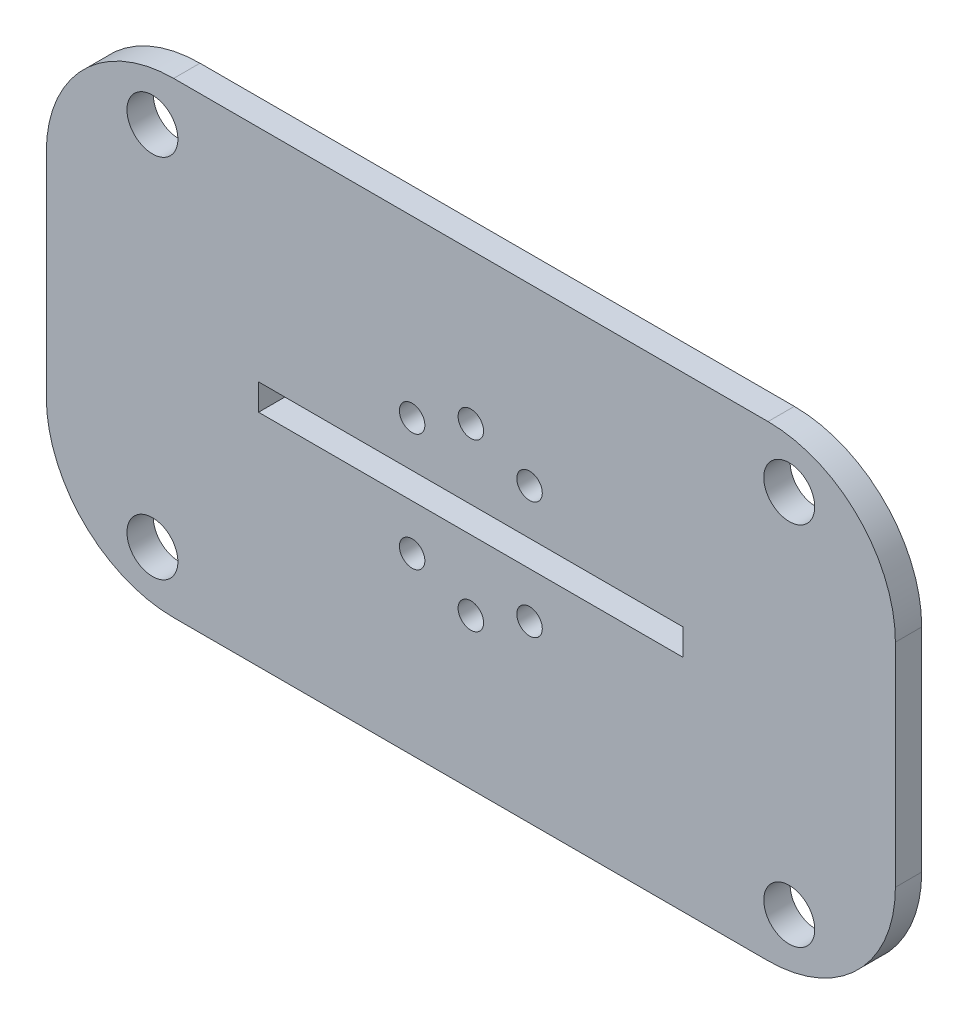
ISO-10303-21;
HEADER;
FILE_DESCRIPTION(('STEP AP214'),'2;1');
FILE_NAME('part.step','',(''),(''),'','','');
FILE_SCHEMA(('AUTOMOTIVE_DESIGN { 1 0 10303 214 1 1 1 1 }'));
ENDSEC;
DATA;
#1=APPLICATION_CONTEXT('core data for automotive mechanical design processes');
#2=APPLICATION_PROTOCOL_DEFINITION('international standard','automotive_design',2000,#1);
#3=PRODUCT_CONTEXT('',#1,'mechanical');
#4=PRODUCT('Part','Part','',(#3));
#5=PRODUCT_RELATED_PRODUCT_CATEGORY('part','',(#4));
#6=PRODUCT_DEFINITION_FORMATION('','',#4);
#7=PRODUCT_DEFINITION_CONTEXT('part definition',#1,'design');
#8=PRODUCT_DEFINITION('design','',#6,#7);
#9=PRODUCT_DEFINITION_SHAPE('','',#8);
#10=(LENGTH_UNIT() NAMED_UNIT(*) SI_UNIT(.MILLI.,.METRE.));
#11=(NAMED_UNIT(*) PLANE_ANGLE_UNIT() SI_UNIT($,.RADIAN.));
#12=(NAMED_UNIT(*) SI_UNIT($,.STERADIAN.) SOLID_ANGLE_UNIT());
#13=UNCERTAINTY_MEASURE_WITH_UNIT(LENGTH_MEASURE(1.E-05),#10,'distance_accuracy_value','');
#14=(GEOMETRIC_REPRESENTATION_CONTEXT(3) GLOBAL_UNCERTAINTY_ASSIGNED_CONTEXT((#13)) GLOBAL_UNIT_ASSIGNED_CONTEXT((#10,
#11,#12)) REPRESENTATION_CONTEXT('',''));
#15=CARTESIAN_POINT('',(0.,0.,0.));
#16=DIRECTION('',(0.,0.,1.));
#17=DIRECTION('',(1.,0.,0.));
#18=AXIS2_PLACEMENT_3D('',#15,#16,#17);
#19=CARTESIAN_POINT('',(0.,0.,3.1));
#20=DIRECTION('',(0.,0.,-1.));
#21=DIRECTION('',(-1.,0.,0.));
#22=AXIS2_PLACEMENT_3D('',#19,#20,#21);
#23=PLANE('',#22);
#24=CARTESIAN_POINT('',(-6.91479721322323,-6.91479721322326,3.1));
#25=DIRECTION('',(0.,0.,1.));
#26=DIRECTION('',(1.,0.,0.));
#27=AXIS2_PLACEMENT_3D('',#24,#25,#26);
#28=CIRCLE('',#27,1.5);
#29=CARTESIAN_POINT('',(-5.41479721322323,-6.91479721322326,3.1));
#30=VERTEX_POINT('',#29);
#31=EDGE_CURVE('E545',#30,#30,#28,.T.);
#32=ORIENTED_EDGE('',*,*,#31,.F.);
#33=EDGE_LOOP('',(#32));
#34=FACE_BOUND('',#33,.T.);
#35=CARTESIAN_POINT('',(0.,-9.779,3.1));
#36=DIRECTION('',(0.,0.,1.));
#37=DIRECTION('',(1.,0.,0.));
#38=AXIS2_PLACEMENT_3D('',#35,#36,#37);
#39=CIRCLE('',#38,1.5);
#40=CARTESIAN_POINT('',(1.50000000000002,-9.779,3.1));
#41=VERTEX_POINT('',#40);
#42=EDGE_CURVE('E539',#41,#41,#39,.T.);
#43=ORIENTED_EDGE('',*,*,#42,.F.);
#44=EDGE_LOOP('',(#43));
#45=FACE_BOUND('',#44,.T.);
#46=CARTESIAN_POINT('',(6.91479721322326,-6.91479721322323,3.1));
#47=DIRECTION('',(0.,0.,1.));
#48=DIRECTION('',(1.,0.,0.));
#49=AXIS2_PLACEMENT_3D('',#46,#47,#48);
#50=CIRCLE('',#49,1.5);
#51=CARTESIAN_POINT('',(8.41479721322326,-6.91479721322323,3.1));
#52=VERTEX_POINT('',#51);
#53=EDGE_CURVE('E533',#52,#52,#50,.T.);
#54=ORIENTED_EDGE('',*,*,#53,.F.);
#55=EDGE_LOOP('',(#54));
#56=FACE_BOUND('',#55,.T.);
#57=CARTESIAN_POINT('',(6.91479721322323,6.91479721322326,3.1));
#58=DIRECTION('',(0.,0.,1.));
#59=DIRECTION('',(1.,0.,0.));
#60=AXIS2_PLACEMENT_3D('',#57,#58,#59);
#61=CIRCLE('',#60,1.5);
#62=CARTESIAN_POINT('',(8.41479721322324,6.91479721322326,3.1));
#63=VERTEX_POINT('',#62);
#64=EDGE_CURVE('E527',#63,#63,#61,.T.);
#65=ORIENTED_EDGE('',*,*,#64,.F.);
#66=EDGE_LOOP('',(#65));
#67=FACE_BOUND('',#66,.T.);
#68=CARTESIAN_POINT('',(0.,9.779,3.1));
#69=DIRECTION('',(0.,0.,1.));
#70=DIRECTION('',(1.,0.,0.));
#71=AXIS2_PLACEMENT_3D('',#68,#69,#70);
#72=CIRCLE('',#71,1.49999999999994);
#73=CARTESIAN_POINT('',(1.49999999999992,9.779,3.1));
#74=VERTEX_POINT('',#73);
#75=EDGE_CURVE('E521',#74,#74,#72,.T.);
#76=ORIENTED_EDGE('',*,*,#75,.F.);
#77=EDGE_LOOP('',(#76));
#78=FACE_BOUND('',#77,.T.);
#79=CARTESIAN_POINT('',(-6.91479721322326,6.91479721322323,3.1));
#80=DIRECTION('',(0.,0.,1.));
#81=DIRECTION('',(1.,0.,0.));
#82=AXIS2_PLACEMENT_3D('',#79,#80,#81);
#83=CIRCLE('',#82,1.5);
#84=CARTESIAN_POINT('',(-5.41479721322326,6.91479721322323,3.1));
#85=VERTEX_POINT('',#84);
#86=EDGE_CURVE('E488',#85,#85,#83,.T.);
#87=ORIENTED_EDGE('',*,*,#86,.F.);
#88=EDGE_LOOP('',(#87));
#89=FACE_BOUND('',#88,.T.);
#90=CARTESIAN_POINT('',(-37.5,-21.55,3.1));
#91=DIRECTION('',(0.,0.,1.));
#92=DIRECTION('',(1.,0.,0.));
#93=AXIS2_PLACEMENT_3D('',#90,#91,#92);
#94=CIRCLE('',#93,3.);
#95=CARTESIAN_POINT('',(-34.5,-21.55,3.1));
#96=VERTEX_POINT('',#95);
#97=EDGE_CURVE('E492',#96,#96,#94,.T.);
#98=ORIENTED_EDGE('',*,*,#97,.F.);
#99=EDGE_LOOP('',(#98));
#100=FACE_BOUND('',#99,.T.);
#101=CARTESIAN_POINT('',(37.5,21.55,3.1));
#102=DIRECTION('',(0.,0.,1.));
#103=DIRECTION('',(1.,0.,0.));
#104=AXIS2_PLACEMENT_3D('',#101,#102,#103);
#105=CIRCLE('',#104,3.);
#106=CARTESIAN_POINT('',(40.5,21.55,3.1));
#107=VERTEX_POINT('',#106);
#108=EDGE_CURVE('E157',#107,#107,#105,.T.);
#109=ORIENTED_EDGE('',*,*,#108,.F.);
#110=EDGE_LOOP('',(#109));
#111=FACE_BOUND('',#110,.T.);
#112=DIRECTION('',(-1.,0.,0.));
#113=VECTOR('',#112,1.);
#114=CARTESIAN_POINT('',(-50.,27.5,3.1));
#115=LINE('',#114,#113);
#116=CARTESIAN_POINT('',(35.,27.5,3.1));
#117=VERTEX_POINT('',#116);
#118=CARTESIAN_POINT('',(-35.,27.5,3.1));
#119=VERTEX_POINT('',#118);
#120=EDGE_CURVE('E171',#117,#119,#115,.T.);
#121=ORIENTED_EDGE('',*,*,#120,.T.);
#122=CARTESIAN_POINT('',(-35.,12.5,3.1));
#123=DIRECTION('',(0.,0.,-1.));
#124=DIRECTION('',(-1.,0.,0.));
#125=AXIS2_PLACEMENT_3D('',#122,#123,#124);
#126=CIRCLE('',#125,15.);
#127=CARTESIAN_POINT('',(-50.,12.5,3.1));
#128=VERTEX_POINT('',#127);
#129=EDGE_CURVE('E211',#119,#128,#126,.F.);
#130=ORIENTED_EDGE('',*,*,#129,.T.);
#131=DIRECTION('',(0.,-1.,0.));
#132=VECTOR('',#131,1.);
#133=CARTESIAN_POINT('',(-50.,-27.5,3.1));
#134=LINE('',#133,#132);
#135=CARTESIAN_POINT('',(-50.,-12.5,3.1));
#136=VERTEX_POINT('',#135);
#137=EDGE_CURVE('E175',#128,#136,#134,.T.);
#138=ORIENTED_EDGE('',*,*,#137,.T.);
#139=CARTESIAN_POINT('',(-35.,-12.5,3.1));
#140=DIRECTION('',(0.,0.,-1.));
#141=DIRECTION('',(-1.,0.,0.));
#142=AXIS2_PLACEMENT_3D('',#139,#140,#141);
#143=CIRCLE('',#142,15.);
#144=CARTESIAN_POINT('',(-35.,-27.5,3.1));
#145=VERTEX_POINT('',#144);
#146=EDGE_CURVE('E54',#136,#145,#143,.F.);
#147=ORIENTED_EDGE('',*,*,#146,.T.);
#148=DIRECTION('',(1.,0.,0.));
#149=VECTOR('',#148,1.);
#150=CARTESIAN_POINT('',(-50.,-27.5,3.1));
#151=LINE('',#150,#149);
#152=CARTESIAN_POINT('',(35.,-27.5,3.1));
#153=VERTEX_POINT('',#152);
#154=EDGE_CURVE('E177',#145,#153,#151,.T.);
#155=ORIENTED_EDGE('',*,*,#154,.T.);
#156=CARTESIAN_POINT('',(35.,-12.5,3.1));
#157=DIRECTION('',(0.,0.,-1.));
#158=DIRECTION('',(-1.,0.,0.));
#159=AXIS2_PLACEMENT_3D('',#156,#157,#158);
#160=CIRCLE('',#159,15.);
#161=CARTESIAN_POINT('',(50.,-12.5,3.1));
#162=VERTEX_POINT('',#161);
#163=EDGE_CURVE('E208',#153,#162,#160,.F.);
#164=ORIENTED_EDGE('',*,*,#163,.T.);
#165=DIRECTION('',(0.,1.,0.));
#166=VECTOR('',#165,1.);
#167=CARTESIAN_POINT('',(50.,-27.5,3.1));
#168=LINE('',#167,#166);
#169=CARTESIAN_POINT('',(50.,12.5,3.1));
#170=VERTEX_POINT('',#169);
#171=EDGE_CURVE('E168',#162,#170,#168,.T.);
#172=ORIENTED_EDGE('',*,*,#171,.T.);
#173=CARTESIAN_POINT('',(35.,12.5,3.1));
#174=DIRECTION('',(0.,0.,-1.));
#175=DIRECTION('',(-1.,0.,0.));
#176=AXIS2_PLACEMENT_3D('',#173,#174,#175);
#177=CIRCLE('',#176,15.);
#178=EDGE_CURVE('E206',#170,#117,#177,.F.);
#179=ORIENTED_EDGE('',*,*,#178,.T.);
#180=EDGE_LOOP('',(#121,#130,#138,#147,#155,#164,#172,#179));
#181=FACE_BOUND('',#180,.T.);
#182=DIRECTION('',(0.,1.,0.));
#183=VECTOR('',#182,1.);
#184=CARTESIAN_POINT('',(25.,-1.55,3.1));
#185=LINE('',#184,#183);
#186=CARTESIAN_POINT('',(25.,-1.55,3.1));
#187=VERTEX_POINT('',#186);
#188=CARTESIAN_POINT('',(25.,1.55,3.1));
#189=VERTEX_POINT('',#188);
#190=EDGE_CURVE('E124',#187,#189,#185,.T.);
#191=ORIENTED_EDGE('',*,*,#190,.F.);
#192=DIRECTION('',(1.,0.,0.));
#193=VECTOR('',#192,1.);
#194=CARTESIAN_POINT('',(-25.,-1.55,3.1));
#195=LINE('',#194,#193);
#196=CARTESIAN_POINT('',(-25.,-1.55,3.1));
#197=VERTEX_POINT('',#196);
#198=EDGE_CURVE('E150',#197,#187,#195,.T.);
#199=ORIENTED_EDGE('',*,*,#198,.F.);
#200=DIRECTION('',(0.,-1.,0.));
#201=VECTOR('',#200,1.);
#202=CARTESIAN_POINT('',(-25.,-1.55,3.1));
#203=LINE('',#202,#201);
#204=CARTESIAN_POINT('',(-25.,1.55,3.1));
#205=VERTEX_POINT('',#204);
#206=EDGE_CURVE('E148',#205,#197,#203,.T.);
#207=ORIENTED_EDGE('',*,*,#206,.F.);
#208=DIRECTION('',(-1.,0.,0.));
#209=VECTOR('',#208,1.);
#210=CARTESIAN_POINT('',(-25.,1.55,3.1));
#211=LINE('',#210,#209);
#212=EDGE_CURVE('E134',#189,#205,#211,.T.);
#213=ORIENTED_EDGE('',*,*,#212,.F.);
#214=EDGE_LOOP('',(#191,#199,#207,#213));
#215=FACE_BOUND('',#214,.T.);
#216=CARTESIAN_POINT('',(-37.5,21.55,3.1));
#217=DIRECTION('',(0.,0.,1.));
#218=DIRECTION('',(-1.,0.,0.));
#219=AXIS2_PLACEMENT_3D('',#216,#217,#218);
#220=CIRCLE('',#219,3.);
#221=CARTESIAN_POINT('',(-40.5,21.55,3.1));
#222=VERTEX_POINT('',#221);
#223=EDGE_CURVE('E497',#222,#222,#220,.T.);
#224=ORIENTED_EDGE('',*,*,#223,.F.);
#225=EDGE_LOOP('',(#224));
#226=FACE_BOUND('',#225,.T.);
#227=CARTESIAN_POINT('',(37.5,-21.55,3.1));
#228=DIRECTION('',(0.,0.,1.));
#229=DIRECTION('',(-1.,0.,0.));
#230=AXIS2_PLACEMENT_3D('',#227,#228,#229);
#231=CIRCLE('',#230,3.);
#232=CARTESIAN_POINT('',(34.5,-21.55,3.1));
#233=VERTEX_POINT('',#232);
#234=EDGE_CURVE('E481',#233,#233,#231,.T.);
#235=ORIENTED_EDGE('',*,*,#234,.F.);
#236=EDGE_LOOP('',(#235));
#237=FACE_BOUND('',#236,.T.);
#238=ADVANCED_FACE('F32',(#34,#45,#56,#67,#78,#89,#100,#111,#181,#215,#226,#237),#23,.F.);
#239=CARTESIAN_POINT('',(0.,0.,0.));
#240=DIRECTION('',(0.,0.,-1.));
#241=DIRECTION('',(-1.,0.,0.));
#242=AXIS2_PLACEMENT_3D('',#239,#240,#241);
#243=PLANE('',#242);
#244=CARTESIAN_POINT('',(-6.91479721322323,-6.91479721322326,0.));
#245=DIRECTION('',(0.,0.,1.));
#246=DIRECTION('',(1.,0.,0.));
#247=AXIS2_PLACEMENT_3D('',#244,#245,#246);
#248=CIRCLE('',#247,1.5);
#249=CARTESIAN_POINT('',(-5.41479721322323,-6.91479721322326,0.));
#250=VERTEX_POINT('',#249);
#251=EDGE_CURVE('E542',#250,#250,#248,.T.);
#252=ORIENTED_EDGE('',*,*,#251,.T.);
#253=EDGE_LOOP('',(#252));
#254=FACE_BOUND('',#253,.T.);
#255=CARTESIAN_POINT('',(0.,-9.779,0.));
#256=DIRECTION('',(0.,0.,1.));
#257=DIRECTION('',(1.,0.,0.));
#258=AXIS2_PLACEMENT_3D('',#255,#256,#257);
#259=CIRCLE('',#258,1.5);
#260=CARTESIAN_POINT('',(1.50000000000002,-9.779,0.));
#261=VERTEX_POINT('',#260);
#262=EDGE_CURVE('E536',#261,#261,#259,.T.);
#263=ORIENTED_EDGE('',*,*,#262,.T.);
#264=EDGE_LOOP('',(#263));
#265=FACE_BOUND('',#264,.T.);
#266=CARTESIAN_POINT('',(6.91479721322326,-6.91479721322323,0.));
#267=DIRECTION('',(0.,0.,1.));
#268=DIRECTION('',(1.,0.,0.));
#269=AXIS2_PLACEMENT_3D('',#266,#267,#268);
#270=CIRCLE('',#269,1.5);
#271=CARTESIAN_POINT('',(8.41479721322326,-6.91479721322323,0.));
#272=VERTEX_POINT('',#271);
#273=EDGE_CURVE('E530',#272,#272,#270,.T.);
#274=ORIENTED_EDGE('',*,*,#273,.T.);
#275=EDGE_LOOP('',(#274));
#276=FACE_BOUND('',#275,.T.);
#277=CARTESIAN_POINT('',(6.91479721322323,6.91479721322326,0.));
#278=DIRECTION('',(0.,0.,1.));
#279=DIRECTION('',(1.,0.,0.));
#280=AXIS2_PLACEMENT_3D('',#277,#278,#279);
#281=CIRCLE('',#280,1.5);
#282=CARTESIAN_POINT('',(8.41479721322324,6.91479721322326,0.));
#283=VERTEX_POINT('',#282);
#284=EDGE_CURVE('E524',#283,#283,#281,.T.);
#285=ORIENTED_EDGE('',*,*,#284,.T.);
#286=EDGE_LOOP('',(#285));
#287=FACE_BOUND('',#286,.T.);
#288=CARTESIAN_POINT('',(0.,9.779,0.));
#289=DIRECTION('',(0.,0.,1.));
#290=DIRECTION('',(1.,0.,0.));
#291=AXIS2_PLACEMENT_3D('',#288,#289,#290);
#292=CIRCLE('',#291,1.49999999999994);
#293=CARTESIAN_POINT('',(1.49999999999992,9.779,0.));
#294=VERTEX_POINT('',#293);
#295=EDGE_CURVE('E519',#294,#294,#292,.T.);
#296=ORIENTED_EDGE('',*,*,#295,.T.);
#297=EDGE_LOOP('',(#296));
#298=FACE_BOUND('',#297,.T.);
#299=CARTESIAN_POINT('',(-6.91479721322326,6.91479721322323,0.));
#300=DIRECTION('',(0.,0.,1.));
#301=DIRECTION('',(1.,0.,0.));
#302=AXIS2_PLACEMENT_3D('',#299,#300,#301);
#303=CIRCLE('',#302,1.5);
#304=CARTESIAN_POINT('',(-5.41479721322326,6.91479721322323,0.));
#305=VERTEX_POINT('',#304);
#306=EDGE_CURVE('E482',#305,#305,#303,.T.);
#307=ORIENTED_EDGE('',*,*,#306,.T.);
#308=EDGE_LOOP('',(#307));
#309=FACE_BOUND('',#308,.T.);
#310=CARTESIAN_POINT('',(-37.5,-21.55,0.));
#311=DIRECTION('',(0.,0.,1.));
#312=DIRECTION('',(1.,0.,0.));
#313=AXIS2_PLACEMENT_3D('',#310,#311,#312);
#314=CIRCLE('',#313,3.);
#315=CARTESIAN_POINT('',(-34.5,-21.55,0.));
#316=VERTEX_POINT('',#315);
#317=EDGE_CURVE('E485',#316,#316,#314,.T.);
#318=ORIENTED_EDGE('',*,*,#317,.T.);
#319=EDGE_LOOP('',(#318));
#320=FACE_BOUND('',#319,.T.);
#321=CARTESIAN_POINT('',(37.5,21.55,0.));
#322=DIRECTION('',(0.,0.,1.));
#323=DIRECTION('',(1.,0.,0.));
#324=AXIS2_PLACEMENT_3D('',#321,#322,#323);
#325=CIRCLE('',#324,3.);
#326=CARTESIAN_POINT('',(40.5,21.55,0.));
#327=VERTEX_POINT('',#326);
#328=EDGE_CURVE('E500',#327,#327,#325,.T.);
#329=ORIENTED_EDGE('',*,*,#328,.T.);
#330=EDGE_LOOP('',(#329));
#331=FACE_BOUND('',#330,.T.);
#332=DIRECTION('',(0.,-1.,0.));
#333=VECTOR('',#332,1.);
#334=CARTESIAN_POINT('',(-50.,-27.5,0.));
#335=LINE('',#334,#333);
#336=CARTESIAN_POINT('',(-50.,12.5,0.));
#337=VERTEX_POINT('',#336);
#338=CARTESIAN_POINT('',(-50.,-12.5,0.));
#339=VERTEX_POINT('',#338);
#340=EDGE_CURVE('E185',#337,#339,#335,.T.);
#341=ORIENTED_EDGE('',*,*,#340,.F.);
#342=CARTESIAN_POINT('',(-35.,12.5,0.));
#343=DIRECTION('',(0.,0.,-1.));
#344=DIRECTION('',(-1.,0.,0.));
#345=AXIS2_PLACEMENT_3D('',#342,#343,#344);
#346=CIRCLE('',#345,15.);
#347=CARTESIAN_POINT('',(-35.,27.5,0.));
#348=VERTEX_POINT('',#347);
#349=EDGE_CURVE('E199',#337,#348,#346,.T.);
#350=ORIENTED_EDGE('',*,*,#349,.T.);
#351=DIRECTION('',(-1.,0.,0.));
#352=VECTOR('',#351,1.);
#353=CARTESIAN_POINT('',(-50.,27.5,0.));
#354=LINE('',#353,#352);
#355=CARTESIAN_POINT('',(35.,27.5,0.));
#356=VERTEX_POINT('',#355);
#357=EDGE_CURVE('E182',#356,#348,#354,.T.);
#358=ORIENTED_EDGE('',*,*,#357,.F.);
#359=CARTESIAN_POINT('',(35.,12.5,0.));
#360=DIRECTION('',(0.,0.,-1.));
#361=DIRECTION('',(-1.,0.,0.));
#362=AXIS2_PLACEMENT_3D('',#359,#360,#361);
#363=CIRCLE('',#362,15.);
#364=CARTESIAN_POINT('',(50.,12.5,0.));
#365=VERTEX_POINT('',#364);
#366=EDGE_CURVE('E193',#356,#365,#363,.T.);
#367=ORIENTED_EDGE('',*,*,#366,.T.);
#368=DIRECTION('',(0.,1.,0.));
#369=VECTOR('',#368,1.);
#370=CARTESIAN_POINT('',(50.,-27.5,0.));
#371=LINE('',#370,#369);
#372=CARTESIAN_POINT('',(50.,-12.5,0.));
#373=VERTEX_POINT('',#372);
#374=EDGE_CURVE('E142',#373,#365,#371,.T.);
#375=ORIENTED_EDGE('',*,*,#374,.F.);
#376=CARTESIAN_POINT('',(35.,-12.5,0.));
#377=DIRECTION('',(0.,0.,-1.));
#378=DIRECTION('',(-1.,0.,0.));
#379=AXIS2_PLACEMENT_3D('',#376,#377,#378);
#380=CIRCLE('',#379,15.);
#381=CARTESIAN_POINT('',(35.,-27.5,0.));
#382=VERTEX_POINT('',#381);
#383=EDGE_CURVE('E195',#373,#382,#380,.T.);
#384=ORIENTED_EDGE('',*,*,#383,.T.);
#385=DIRECTION('',(1.,0.,0.));
#386=VECTOR('',#385,1.);
#387=CARTESIAN_POINT('',(-50.,-27.5,0.));
#388=LINE('',#387,#386);
#389=CARTESIAN_POINT('',(-35.,-27.5,0.));
#390=VERTEX_POINT('',#389);
#391=EDGE_CURVE('E172',#390,#382,#388,.T.);
#392=ORIENTED_EDGE('',*,*,#391,.F.);
#393=CARTESIAN_POINT('',(-35.,-12.5,0.));
#394=DIRECTION('',(0.,0.,-1.));
#395=DIRECTION('',(-1.,0.,0.));
#396=AXIS2_PLACEMENT_3D('',#393,#394,#395);
#397=CIRCLE('',#396,15.);
#398=EDGE_CURVE('E197',#390,#339,#397,.T.);
#399=ORIENTED_EDGE('',*,*,#398,.T.);
#400=EDGE_LOOP('',(#341,#350,#358,#367,#375,#384,#392,#399));
#401=FACE_BOUND('',#400,.T.);
#402=DIRECTION('',(1.,0.,0.));
#403=VECTOR('',#402,1.);
#404=CARTESIAN_POINT('',(-25.,-1.55,0.));
#405=LINE('',#404,#403);
#406=CARTESIAN_POINT('',(-25.,-1.55,0.));
#407=VERTEX_POINT('',#406);
#408=CARTESIAN_POINT('',(25.,-1.55,0.));
#409=VERTEX_POINT('',#408);
#410=EDGE_CURVE('E135',#407,#409,#405,.T.);
#411=ORIENTED_EDGE('',*,*,#410,.T.);
#412=DIRECTION('',(0.,1.,0.));
#413=VECTOR('',#412,1.);
#414=CARTESIAN_POINT('',(25.,-1.55,0.));
#415=LINE('',#414,#413);
#416=CARTESIAN_POINT('',(25.,1.55,0.));
#417=VERTEX_POINT('',#416);
#418=EDGE_CURVE('E155',#409,#417,#415,.T.);
#419=ORIENTED_EDGE('',*,*,#418,.T.);
#420=DIRECTION('',(-1.,0.,0.));
#421=VECTOR('',#420,1.);
#422=CARTESIAN_POINT('',(-25.,1.55,0.));
#423=LINE('',#422,#421);
#424=CARTESIAN_POINT('',(-25.,1.55,0.));
#425=VERTEX_POINT('',#424);
#426=EDGE_CURVE('E141',#417,#425,#423,.T.);
#427=ORIENTED_EDGE('',*,*,#426,.T.);
#428=DIRECTION('',(0.,-1.,0.));
#429=VECTOR('',#428,1.);
#430=CARTESIAN_POINT('',(-25.,-1.55,0.));
#431=LINE('',#430,#429);
#432=EDGE_CURVE('E159',#425,#407,#431,.T.);
#433=ORIENTED_EDGE('',*,*,#432,.T.);
#434=EDGE_LOOP('',(#411,#419,#427,#433));
#435=FACE_BOUND('',#434,.T.);
#436=CARTESIAN_POINT('',(-37.5,21.55,0.));
#437=DIRECTION('',(0.,0.,1.));
#438=DIRECTION('',(-1.,0.,0.));
#439=AXIS2_PLACEMENT_3D('',#436,#437,#438);
#440=CIRCLE('',#439,3.);
#441=CARTESIAN_POINT('',(-40.5,21.55,0.));
#442=VERTEX_POINT('',#441);
#443=EDGE_CURVE('E476',#442,#442,#440,.T.);
#444=ORIENTED_EDGE('',*,*,#443,.T.);
#445=EDGE_LOOP('',(#444));
#446=FACE_BOUND('',#445,.T.);
#447=CARTESIAN_POINT('',(37.5,-21.55,0.));
#448=DIRECTION('',(0.,0.,1.));
#449=DIRECTION('',(-1.,0.,0.));
#450=AXIS2_PLACEMENT_3D('',#447,#448,#449);
#451=CIRCLE('',#450,3.);
#452=CARTESIAN_POINT('',(34.5,-21.55,0.));
#453=VERTEX_POINT('',#452);
#454=EDGE_CURVE('E479',#453,#453,#451,.T.);
#455=ORIENTED_EDGE('',*,*,#454,.T.);
#456=EDGE_LOOP('',(#455));
#457=FACE_BOUND('',#456,.T.);
#458=ADVANCED_FACE('F233',(#254,#265,#276,#287,#298,#309,#320,#331,#401,#435,#446,#457),#243,.T.);
#459=CARTESIAN_POINT('',(50.,-27.5,3.1));
#460=DIRECTION('',(-1.,0.,0.));
#461=DIRECTION('',(0.,0.,1.));
#462=AXIS2_PLACEMENT_3D('',#459,#460,#461);
#463=PLANE('',#462);
#464=ORIENTED_EDGE('',*,*,#171,.F.);
#465=DIRECTION('',(0.,0.,-1.));
#466=VECTOR('',#465,1.);
#467=CARTESIAN_POINT('',(50.,-12.5,3.1));
#468=LINE('',#467,#466);
#469=EDGE_CURVE('E11',#162,#373,#468,.T.);
#470=ORIENTED_EDGE('',*,*,#469,.T.);
#471=ORIENTED_EDGE('',*,*,#374,.T.);
#472=DIRECTION('',(0.,0.,-1.));
#473=VECTOR('',#472,1.);
#474=CARTESIAN_POINT('',(50.,12.5,3.1));
#475=LINE('',#474,#473);
#476=EDGE_CURVE('E40',#365,#170,#475,.F.);
#477=ORIENTED_EDGE('',*,*,#476,.T.);
#478=EDGE_LOOP('',(#464,#470,#471,#477));
#479=FACE_BOUND('',#478,.T.);
#480=ADVANCED_FACE('F219',(#479),#463,.F.);
#481=CARTESIAN_POINT('',(-50.,27.5,3.1));
#482=DIRECTION('',(0.,-1.,0.));
#483=DIRECTION('',(0.,0.,-1.));
#484=AXIS2_PLACEMENT_3D('',#481,#482,#483);
#485=PLANE('',#484);
#486=ORIENTED_EDGE('',*,*,#357,.T.);
#487=DIRECTION('',(0.,0.,-1.));
#488=VECTOR('',#487,1.);
#489=CARTESIAN_POINT('',(-35.,27.5,3.1));
#490=LINE('',#489,#488);
#491=EDGE_CURVE('E204',#348,#119,#490,.F.);
#492=ORIENTED_EDGE('',*,*,#491,.T.);
#493=ORIENTED_EDGE('',*,*,#120,.F.);
#494=DIRECTION('',(0.,0.,-1.));
#495=VECTOR('',#494,1.);
#496=CARTESIAN_POINT('',(35.,27.5,3.1));
#497=LINE('',#496,#495);
#498=EDGE_CURVE('E201',#117,#356,#497,.T.);
#499=ORIENTED_EDGE('',*,*,#498,.T.);
#500=EDGE_LOOP('',(#486,#492,#493,#499));
#501=FACE_BOUND('',#500,.T.);
#502=ADVANCED_FACE('F229',(#501),#485,.F.);
#503=CARTESIAN_POINT('',(-50.,-27.5,3.1));
#504=DIRECTION('',(1.,0.,0.));
#505=DIRECTION('',(0.,0.,-1.));
#506=AXIS2_PLACEMENT_3D('',#503,#504,#505);
#507=PLANE('',#506);
#508=ORIENTED_EDGE('',*,*,#137,.F.);
#509=DIRECTION('',(0.,0.,-1.));
#510=VECTOR('',#509,1.);
#511=CARTESIAN_POINT('',(-50.,12.5,3.1));
#512=LINE('',#511,#510);
#513=EDGE_CURVE('E190',#128,#337,#512,.T.);
#514=ORIENTED_EDGE('',*,*,#513,.T.);
#515=ORIENTED_EDGE('',*,*,#340,.T.);
#516=DIRECTION('',(0.,0.,-1.));
#517=VECTOR('',#516,1.);
#518=CARTESIAN_POINT('',(-50.,-12.5,3.1));
#519=LINE('',#518,#517);
#520=EDGE_CURVE('E179',#339,#136,#519,.F.);
#521=ORIENTED_EDGE('',*,*,#520,.T.);
#522=EDGE_LOOP('',(#508,#514,#515,#521));
#523=FACE_BOUND('',#522,.T.);
#524=ADVANCED_FACE('F241',(#523),#507,.F.);
#525=CARTESIAN_POINT('',(-50.,-27.5,3.1));
#526=DIRECTION('',(0.,1.,0.));
#527=DIRECTION('',(0.,0.,1.));
#528=AXIS2_PLACEMENT_3D('',#525,#526,#527);
#529=PLANE('',#528);
#530=ORIENTED_EDGE('',*,*,#154,.F.);
#531=DIRECTION('',(0.,0.,-1.));
#532=VECTOR('',#531,1.);
#533=CARTESIAN_POINT('',(-35.,-27.5,3.1));
#534=LINE('',#533,#532);
#535=EDGE_CURVE('E214',#145,#390,#534,.T.);
#536=ORIENTED_EDGE('',*,*,#535,.T.);
#537=ORIENTED_EDGE('',*,*,#391,.T.);
#538=DIRECTION('',(0.,0.,-1.));
#539=VECTOR('',#538,1.);
#540=CARTESIAN_POINT('',(35.,-27.5,3.1));
#541=LINE('',#540,#539);
#542=EDGE_CURVE('E47',#382,#153,#541,.F.);
#543=ORIENTED_EDGE('',*,*,#542,.T.);
#544=EDGE_LOOP('',(#530,#536,#537,#543));
#545=FACE_BOUND('',#544,.T.);
#546=ADVANCED_FACE('F247',(#545),#529,.F.);
#547=CARTESIAN_POINT('',(25.,-1.55,3.1));
#548=DIRECTION('',(-1.,0.,0.));
#549=DIRECTION('',(0.,0.,1.));
#550=AXIS2_PLACEMENT_3D('',#547,#548,#549);
#551=PLANE('',#550);
#552=ORIENTED_EDGE('',*,*,#418,.F.);
#553=DIRECTION('',(0.,0.,-1.));
#554=VECTOR('',#553,1.);
#555=CARTESIAN_POINT('',(25.,-1.55,3.1));
#556=LINE('',#555,#554);
#557=EDGE_CURVE('E130',#187,#409,#556,.T.);
#558=ORIENTED_EDGE('',*,*,#557,.F.);
#559=ORIENTED_EDGE('',*,*,#190,.T.);
#560=DIRECTION('',(0.,0.,-1.));
#561=VECTOR('',#560,1.);
#562=CARTESIAN_POINT('',(25.,1.55,3.1));
#563=LINE('',#562,#561);
#564=EDGE_CURVE('E127',#189,#417,#563,.T.);
#565=ORIENTED_EDGE('',*,*,#564,.T.);
#566=EDGE_LOOP('',(#552,#558,#559,#565));
#567=FACE_BOUND('',#566,.T.);
#568=ADVANCED_FACE('F126',(#567),#551,.T.);
#569=CARTESIAN_POINT('',(-25.,1.55,3.1));
#570=DIRECTION('',(0.,-1.,0.));
#571=DIRECTION('',(0.,0.,-1.));
#572=AXIS2_PLACEMENT_3D('',#569,#570,#571);
#573=PLANE('',#572);
#574=ORIENTED_EDGE('',*,*,#426,.F.);
#575=ORIENTED_EDGE('',*,*,#564,.F.);
#576=ORIENTED_EDGE('',*,*,#212,.T.);
#577=DIRECTION('',(0.,0.,-1.));
#578=VECTOR('',#577,1.);
#579=CARTESIAN_POINT('',(-25.,1.55,3.1));
#580=LINE('',#579,#578);
#581=EDGE_CURVE('E143',#205,#425,#580,.T.);
#582=ORIENTED_EDGE('',*,*,#581,.T.);
#583=EDGE_LOOP('',(#574,#575,#576,#582));
#584=FACE_BOUND('',#583,.T.);
#585=ADVANCED_FACE('F138',(#584),#573,.T.);
#586=CARTESIAN_POINT('',(-25.,-1.55,3.1));
#587=DIRECTION('',(1.,0.,0.));
#588=DIRECTION('',(0.,0.,-1.));
#589=AXIS2_PLACEMENT_3D('',#586,#587,#588);
#590=PLANE('',#589);
#591=ORIENTED_EDGE('',*,*,#432,.F.);
#592=ORIENTED_EDGE('',*,*,#581,.F.);
#593=ORIENTED_EDGE('',*,*,#206,.T.);
#594=DIRECTION('',(0.,0.,-1.));
#595=VECTOR('',#594,1.);
#596=CARTESIAN_POINT('',(-25.,-1.55,3.1));
#597=LINE('',#596,#595);
#598=EDGE_CURVE('E165',#197,#407,#597,.T.);
#599=ORIENTED_EDGE('',*,*,#598,.T.);
#600=EDGE_LOOP('',(#591,#592,#593,#599));
#601=FACE_BOUND('',#600,.T.);
#602=ADVANCED_FACE('F328',(#601),#590,.T.);
#603=CARTESIAN_POINT('',(-25.,-1.55,3.1));
#604=DIRECTION('',(0.,1.,0.));
#605=DIRECTION('',(0.,0.,1.));
#606=AXIS2_PLACEMENT_3D('',#603,#604,#605);
#607=PLANE('',#606);
#608=ORIENTED_EDGE('',*,*,#410,.F.);
#609=ORIENTED_EDGE('',*,*,#598,.F.);
#610=ORIENTED_EDGE('',*,*,#198,.T.);
#611=ORIENTED_EDGE('',*,*,#557,.T.);
#612=EDGE_LOOP('',(#608,#609,#610,#611));
#613=FACE_BOUND('',#612,.T.);
#614=ADVANCED_FACE('F324',(#613),#607,.T.);
#615=CARTESIAN_POINT('',(37.5,21.55,3.1));
#616=DIRECTION('',(0.,0.,-1.));
#617=DIRECTION('',(-1.,0.,0.));
#618=AXIS2_PLACEMENT_3D('',#615,#616,#617);
#619=CYLINDRICAL_SURFACE('',#618,3.);
#620=ORIENTED_EDGE('',*,*,#108,.T.);
#621=EDGE_LOOP('',(#620));
#622=FACE_BOUND('',#621,.T.);
#623=ORIENTED_EDGE('',*,*,#328,.F.);
#624=EDGE_LOOP('',(#623));
#625=FACE_BOUND('',#624,.T.);
#626=ADVANCED_FACE('F320',(#622,#625),#619,.F.);
#627=CARTESIAN_POINT('',(-37.5,21.55,3.1));
#628=DIRECTION('',(0.,0.,-1.));
#629=DIRECTION('',(-1.,0.,0.));
#630=AXIS2_PLACEMENT_3D('',#627,#628,#629);
#631=CYLINDRICAL_SURFACE('',#630,3.);
#632=ORIENTED_EDGE('',*,*,#223,.T.);
#633=EDGE_LOOP('',(#632));
#634=FACE_BOUND('',#633,.T.);
#635=ORIENTED_EDGE('',*,*,#443,.F.);
#636=EDGE_LOOP('',(#635));
#637=FACE_BOUND('',#636,.T.);
#638=ADVANCED_FACE('F316',(#634,#637),#631,.F.);
#639=CARTESIAN_POINT('',(-37.5,-21.55,3.1));
#640=DIRECTION('',(0.,0.,-1.));
#641=DIRECTION('',(-1.,0.,0.));
#642=AXIS2_PLACEMENT_3D('',#639,#640,#641);
#643=CYLINDRICAL_SURFACE('',#642,3.);
#644=ORIENTED_EDGE('',*,*,#97,.T.);
#645=EDGE_LOOP('',(#644));
#646=FACE_BOUND('',#645,.T.);
#647=ORIENTED_EDGE('',*,*,#317,.F.);
#648=EDGE_LOOP('',(#647));
#649=FACE_BOUND('',#648,.T.);
#650=ADVANCED_FACE('F312',(#646,#649),#643,.F.);
#651=CARTESIAN_POINT('',(37.5,-21.55,3.1));
#652=DIRECTION('',(0.,0.,-1.));
#653=DIRECTION('',(-1.,0.,0.));
#654=AXIS2_PLACEMENT_3D('',#651,#652,#653);
#655=CYLINDRICAL_SURFACE('',#654,3.);
#656=ORIENTED_EDGE('',*,*,#234,.T.);
#657=EDGE_LOOP('',(#656));
#658=FACE_BOUND('',#657,.T.);
#659=ORIENTED_EDGE('',*,*,#454,.F.);
#660=EDGE_LOOP('',(#659));
#661=FACE_BOUND('',#660,.T.);
#662=ADVANCED_FACE('F308',(#658,#661),#655,.F.);
#663=CARTESIAN_POINT('',(-6.91479721322326,6.91479721322323,0.));
#664=DIRECTION('',(0.,0.,1.));
#665=DIRECTION('',(1.,0.,0.));
#666=AXIS2_PLACEMENT_3D('',#663,#664,#665);
#667=CYLINDRICAL_SURFACE('',#666,1.5);
#668=ORIENTED_EDGE('',*,*,#306,.F.);
#669=EDGE_LOOP('',(#668));
#670=FACE_BOUND('',#669,.T.);
#671=ORIENTED_EDGE('',*,*,#86,.T.);
#672=EDGE_LOOP('',(#671));
#673=FACE_BOUND('',#672,.T.);
#674=ADVANCED_FACE('F304',(#670,#673),#667,.F.);
#675=CARTESIAN_POINT('',(0.,9.779,0.));
#676=DIRECTION('',(0.,0.,1.));
#677=DIRECTION('',(1.,0.,0.));
#678=AXIS2_PLACEMENT_3D('',#675,#676,#677);
#679=CYLINDRICAL_SURFACE('',#678,1.49999999999994);
#680=ORIENTED_EDGE('',*,*,#295,.F.);
#681=EDGE_LOOP('',(#680));
#682=FACE_BOUND('',#681,.T.);
#683=ORIENTED_EDGE('',*,*,#75,.T.);
#684=EDGE_LOOP('',(#683));
#685=FACE_BOUND('',#684,.T.);
#686=ADVANCED_FACE('F300',(#682,#685),#679,.F.);
#687=CARTESIAN_POINT('',(6.91479721322323,6.91479721322326,0.));
#688=DIRECTION('',(0.,0.,1.));
#689=DIRECTION('',(1.,0.,0.));
#690=AXIS2_PLACEMENT_3D('',#687,#688,#689);
#691=CYLINDRICAL_SURFACE('',#690,1.5);
#692=ORIENTED_EDGE('',*,*,#284,.F.);
#693=EDGE_LOOP('',(#692));
#694=FACE_BOUND('',#693,.T.);
#695=ORIENTED_EDGE('',*,*,#64,.T.);
#696=EDGE_LOOP('',(#695));
#697=FACE_BOUND('',#696,.T.);
#698=ADVANCED_FACE('F296',(#694,#697),#691,.F.);
#699=CARTESIAN_POINT('',(6.91479721322326,-6.91479721322323,0.));
#700=DIRECTION('',(0.,0.,1.));
#701=DIRECTION('',(1.,0.,0.));
#702=AXIS2_PLACEMENT_3D('',#699,#700,#701);
#703=CYLINDRICAL_SURFACE('',#702,1.5);
#704=ORIENTED_EDGE('',*,*,#273,.F.);
#705=EDGE_LOOP('',(#704));
#706=FACE_BOUND('',#705,.T.);
#707=ORIENTED_EDGE('',*,*,#53,.T.);
#708=EDGE_LOOP('',(#707));
#709=FACE_BOUND('',#708,.T.);
#710=ADVANCED_FACE('F288',(#706,#709),#703,.F.);
#711=CARTESIAN_POINT('',(0.,-9.779,0.));
#712=DIRECTION('',(0.,0.,1.));
#713=DIRECTION('',(1.,0.,0.));
#714=AXIS2_PLACEMENT_3D('',#711,#712,#713);
#715=CYLINDRICAL_SURFACE('',#714,1.5);
#716=ORIENTED_EDGE('',*,*,#262,.F.);
#717=EDGE_LOOP('',(#716));
#718=FACE_BOUND('',#717,.T.);
#719=ORIENTED_EDGE('',*,*,#42,.T.);
#720=EDGE_LOOP('',(#719));
#721=FACE_BOUND('',#720,.T.);
#722=ADVANCED_FACE('F282',(#718,#721),#715,.F.);
#723=CARTESIAN_POINT('',(-6.91479721322323,-6.91479721322326,0.));
#724=DIRECTION('',(0.,0.,1.));
#725=DIRECTION('',(1.,0.,0.));
#726=AXIS2_PLACEMENT_3D('',#723,#724,#725);
#727=CYLINDRICAL_SURFACE('',#726,1.5);
#728=ORIENTED_EDGE('',*,*,#251,.F.);
#729=EDGE_LOOP('',(#728));
#730=FACE_BOUND('',#729,.T.);
#731=ORIENTED_EDGE('',*,*,#31,.T.);
#732=EDGE_LOOP('',(#731));
#733=FACE_BOUND('',#732,.T.);
#734=ADVANCED_FACE('F278',(#730,#733),#727,.F.);
#735=CARTESIAN_POINT('',(-35.,12.5,3.1));
#736=DIRECTION('',(0.,0.,-1.));
#737=DIRECTION('',(-1.,0.,0.));
#738=AXIS2_PLACEMENT_3D('',#735,#736,#737);
#739=CYLINDRICAL_SURFACE('',#738,15.);
#740=ORIENTED_EDGE('',*,*,#129,.F.);
#741=ORIENTED_EDGE('',*,*,#491,.F.);
#742=ORIENTED_EDGE('',*,*,#349,.F.);
#743=ORIENTED_EDGE('',*,*,#513,.F.);
#744=EDGE_LOOP('',(#740,#741,#742,#743));
#745=FACE_BOUND('',#744,.T.);
#746=ADVANCED_FACE('F238',(#745),#739,.T.);
#747=CARTESIAN_POINT('',(-35.,-12.5,3.1));
#748=DIRECTION('',(0.,0.,-1.));
#749=DIRECTION('',(-1.,0.,0.));
#750=AXIS2_PLACEMENT_3D('',#747,#748,#749);
#751=CYLINDRICAL_SURFACE('',#750,15.);
#752=ORIENTED_EDGE('',*,*,#146,.F.);
#753=ORIENTED_EDGE('',*,*,#520,.F.);
#754=ORIENTED_EDGE('',*,*,#398,.F.);
#755=ORIENTED_EDGE('',*,*,#535,.F.);
#756=EDGE_LOOP('',(#752,#753,#754,#755));
#757=FACE_BOUND('',#756,.T.);
#758=ADVANCED_FACE('F245',(#757),#751,.T.);
#759=CARTESIAN_POINT('',(35.,-12.5,3.1));
#760=DIRECTION('',(0.,0.,-1.));
#761=DIRECTION('',(-1.,0.,0.));
#762=AXIS2_PLACEMENT_3D('',#759,#760,#761);
#763=CYLINDRICAL_SURFACE('',#762,15.);
#764=ORIENTED_EDGE('',*,*,#163,.F.);
#765=ORIENTED_EDGE('',*,*,#542,.F.);
#766=ORIENTED_EDGE('',*,*,#383,.F.);
#767=ORIENTED_EDGE('',*,*,#469,.F.);
#768=EDGE_LOOP('',(#764,#765,#766,#767));
#769=FACE_BOUND('',#768,.T.);
#770=ADVANCED_FACE('F249',(#769),#763,.T.);
#771=CARTESIAN_POINT('',(35.,12.5,3.1));
#772=DIRECTION('',(0.,0.,-1.));
#773=DIRECTION('',(-1.,0.,0.));
#774=AXIS2_PLACEMENT_3D('',#771,#772,#773);
#775=CYLINDRICAL_SURFACE('',#774,15.);
#776=ORIENTED_EDGE('',*,*,#178,.F.);
#777=ORIENTED_EDGE('',*,*,#476,.F.);
#778=ORIENTED_EDGE('',*,*,#366,.F.);
#779=ORIENTED_EDGE('',*,*,#498,.F.);
#780=EDGE_LOOP('',(#776,#777,#778,#779));
#781=FACE_BOUND('',#780,.T.);
#782=ADVANCED_FACE('F34',(#781),#775,.T.);
#783=CLOSED_SHELL('',(#238,#458,#480,#502,#524,#546,#568,#585,#602,#614,#626,#638,#650,#662,
#674,#686,#698,#710,#722,#734,#746,#758,#770,#782));
#784=MANIFOLD_SOLID_BREP('B2',#783);
#785=ADVANCED_BREP_SHAPE_REPRESENTATION('',(#18,#784),#14);
#786=SHAPE_DEFINITION_REPRESENTATION(#9,#785);
ENDSEC;
END-ISO-10303-21;
